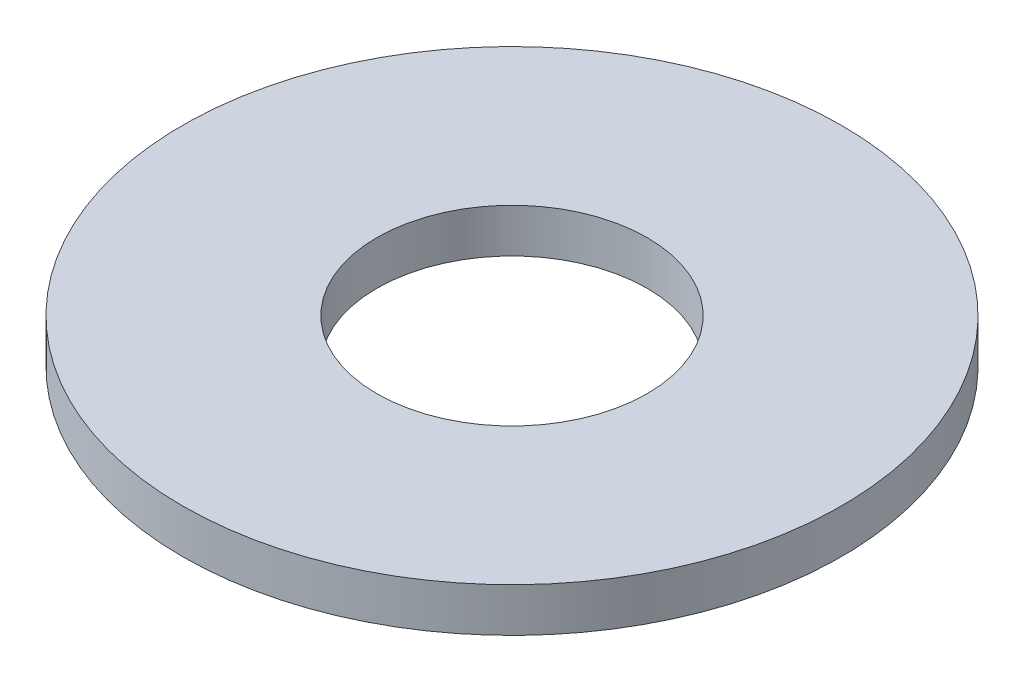
ISO-10303-21;
HEADER;
FILE_DESCRIPTION(('STEP AP214'),'2;1');
FILE_NAME('part.step','',(''),(''),'','','');
FILE_SCHEMA(('AUTOMOTIVE_DESIGN { 1 0 10303 214 1 1 1 1 }'));
ENDSEC;
DATA;
#1=APPLICATION_CONTEXT('core data for automotive mechanical design processes');
#2=APPLICATION_PROTOCOL_DEFINITION('international standard','automotive_design',2000,#1);
#3=PRODUCT_CONTEXT('',#1,'mechanical');
#4=PRODUCT('Part','Part','',(#3));
#5=PRODUCT_RELATED_PRODUCT_CATEGORY('part','',(#4));
#6=PRODUCT_DEFINITION_FORMATION('','',#4);
#7=PRODUCT_DEFINITION_CONTEXT('part definition',#1,'design');
#8=PRODUCT_DEFINITION('design','',#6,#7);
#9=PRODUCT_DEFINITION_SHAPE('','',#8);
#10=(LENGTH_UNIT() NAMED_UNIT(*) SI_UNIT(.MILLI.,.METRE.));
#11=(NAMED_UNIT(*) PLANE_ANGLE_UNIT() SI_UNIT($,.RADIAN.));
#12=(NAMED_UNIT(*) SI_UNIT($,.STERADIAN.) SOLID_ANGLE_UNIT());
#13=UNCERTAINTY_MEASURE_WITH_UNIT(LENGTH_MEASURE(1.E-05),#10,'distance_accuracy_value','');
#14=(GEOMETRIC_REPRESENTATION_CONTEXT(3) GLOBAL_UNCERTAINTY_ASSIGNED_CONTEXT((#13)) GLOBAL_UNIT_ASSIGNED_CONTEXT((#10,
#11,#12)) REPRESENTATION_CONTEXT('',''));
#15=CARTESIAN_POINT('',(0.,0.,0.));
#16=DIRECTION('',(0.,0.,1.));
#17=DIRECTION('',(1.,0.,0.));
#18=AXIS2_PLACEMENT_3D('',#15,#16,#17);
#19=CARTESIAN_POINT('',(0.,13.,0.));
#20=DIRECTION('',(0.,-1.,0.));
#21=DIRECTION('',(0.,0.,-1.));
#22=AXIS2_PLACEMENT_3D('',#19,#20,#21);
#23=CYLINDRICAL_SURFACE('',#22,97.5);
#24=CARTESIAN_POINT('',(0.,13.,0.));
#25=DIRECTION('',(0.,1.,0.));
#26=DIRECTION('',(0.,0.,1.));
#27=AXIS2_PLACEMENT_3D('',#24,#25,#26);
#28=CIRCLE('',#27,97.5);
#29=CARTESIAN_POINT('',(0.,13.,-97.5));
#30=VERTEX_POINT('',#29);
#31=EDGE_CURVE('E10',#30,#30,#28,.T.);
#32=CARTESIAN_POINT('',(0.,0.,0.));
#33=DIRECTION('',(0.,1.,0.));
#34=DIRECTION('',(0.,0.,1.));
#35=AXIS2_PLACEMENT_3D('',#32,#33,#34);
#36=CIRCLE('',#35,97.5);
#37=CARTESIAN_POINT('',(0.,0.,-97.5));
#38=VERTEX_POINT('',#37);
#39=EDGE_CURVE('E37',#38,#38,#36,.T.);
#40=CARTESIAN_POINT('',(0.,13.,-97.5));
#41=CARTESIAN_POINT('',(0.,12.8645833333333,-97.5));
#42=CARTESIAN_POINT('',(0.,12.7291666666667,-97.5));
#43=CARTESIAN_POINT('',(0.,12.4583333333333,-97.5));
#44=CARTESIAN_POINT('',(0.,12.3229166666667,-97.5));
#45=CARTESIAN_POINT('',(0.,12.0520833333333,-97.5));
#46=CARTESIAN_POINT('',(0.,11.9166666666667,-97.5));
#47=CARTESIAN_POINT('',(0.,11.6458333333333,-97.5));
#48=CARTESIAN_POINT('',(0.,11.5104166666667,-97.5));
#49=CARTESIAN_POINT('',(0.,11.2395833333333,-97.5));
#50=CARTESIAN_POINT('',(0.,11.1041666666667,-97.5));
#51=CARTESIAN_POINT('',(0.,10.8333333333333,-97.5));
#52=CARTESIAN_POINT('',(0.,10.6979166666667,-97.5));
#53=CARTESIAN_POINT('',(0.,10.4270833333333,-97.5));
#54=CARTESIAN_POINT('',(0.,10.2916666666667,-97.5));
#55=CARTESIAN_POINT('',(0.,10.0208333333333,-97.5));
#56=CARTESIAN_POINT('',(0.,9.88541666666667,-97.5));
#57=CARTESIAN_POINT('',(0.,9.61458333333333,-97.5));
#58=CARTESIAN_POINT('',(0.,9.47916666666667,-97.5));
#59=CARTESIAN_POINT('',(0.,9.20833333333333,-97.5));
#60=CARTESIAN_POINT('',(0.,9.07291666666667,-97.5));
#61=CARTESIAN_POINT('',(0.,8.80208333333333,-97.5));
#62=CARTESIAN_POINT('',(0.,8.66666666666667,-97.5));
#63=CARTESIAN_POINT('',(0.,8.39583333333333,-97.5));
#64=CARTESIAN_POINT('',(0.,8.26041666666667,-97.5));
#65=CARTESIAN_POINT('',(0.,7.98958333333333,-97.5));
#66=CARTESIAN_POINT('',(0.,7.85416666666667,-97.5));
#67=CARTESIAN_POINT('',(0.,7.58333333333333,-97.5));
#68=CARTESIAN_POINT('',(0.,7.44791666666667,-97.5));
#69=CARTESIAN_POINT('',(0.,7.17708333333333,-97.5));
#70=CARTESIAN_POINT('',(0.,7.04166666666667,-97.5));
#71=CARTESIAN_POINT('',(0.,6.77083333333333,-97.5));
#72=CARTESIAN_POINT('',(0.,6.63541666666667,-97.5));
#73=CARTESIAN_POINT('',(0.,6.36458333333333,-97.5));
#74=CARTESIAN_POINT('',(0.,6.22916666666667,-97.5));
#75=CARTESIAN_POINT('',(0.,5.95833333333333,-97.5));
#76=CARTESIAN_POINT('',(0.,5.82291666666667,-97.5));
#77=CARTESIAN_POINT('',(0.,5.55208333333333,-97.5));
#78=CARTESIAN_POINT('',(0.,5.41666666666667,-97.5));
#79=CARTESIAN_POINT('',(0.,5.14583333333333,-97.5));
#80=CARTESIAN_POINT('',(0.,5.01041666666667,-97.5));
#81=CARTESIAN_POINT('',(0.,4.73958333333333,-97.5));
#82=CARTESIAN_POINT('',(0.,4.60416666666667,-97.5));
#83=CARTESIAN_POINT('',(0.,4.33333333333333,-97.5));
#84=CARTESIAN_POINT('',(0.,4.19791666666667,-97.5));
#85=CARTESIAN_POINT('',(0.,3.92708333333333,-97.5));
#86=CARTESIAN_POINT('',(0.,3.79166666666667,-97.5));
#87=CARTESIAN_POINT('',(0.,3.52083333333333,-97.5));
#88=CARTESIAN_POINT('',(0.,3.38541666666667,-97.5));
#89=CARTESIAN_POINT('',(0.,3.11458333333333,-97.5));
#90=CARTESIAN_POINT('',(0.,2.97916666666667,-97.5));
#91=CARTESIAN_POINT('',(0.,2.70833333333333,-97.5));
#92=CARTESIAN_POINT('',(0.,2.57291666666667,-97.5));
#93=CARTESIAN_POINT('',(0.,2.30208333333333,-97.5));
#94=CARTESIAN_POINT('',(0.,2.16666666666667,-97.5));
#95=CARTESIAN_POINT('',(0.,1.89583333333333,-97.5));
#96=CARTESIAN_POINT('',(0.,1.76041666666667,-97.5));
#97=CARTESIAN_POINT('',(0.,1.48958333333333,-97.5));
#98=CARTESIAN_POINT('',(0.,1.35416666666667,-97.5));
#99=CARTESIAN_POINT('',(0.,1.08333333333333,-97.5));
#100=CARTESIAN_POINT('',(0.,0.947916666666667,-97.5));
#101=CARTESIAN_POINT('',(0.,0.677083333333334,-97.5));
#102=CARTESIAN_POINT('',(0.,0.541666666666667,-97.5));
#103=CARTESIAN_POINT('',(0.,0.270833333333334,-97.5));
#104=CARTESIAN_POINT('',(0.,0.135416666666667,-97.5));
#105=CARTESIAN_POINT('',(0.,0.,-97.5));
#106=B_SPLINE_CURVE_WITH_KNOTS('',3,(#40,#41,#42,#43,#44,#45,#46,#47,#48,#49,#50,#51,#52,#53,
#54,#55,#56,#57,#58,#59,#60,#61,#62,#63,#64,#65,#66,#67,#68,#69,#70,#71,#72,#73,#74,#75,#76,#77,
#78,#79,#80,#81,#82,#83,#84,#85,#86,#87,#88,#89,#90,#91,#92,#93,#94,#95,#96,#97,#98,#99,#100,
#101,#102,#103,#104,#105),.UNSPECIFIED.,.F.,.F.,(4,2,2,2,2,2,2,2,2,2,2,2,2,2,2,2,2,2,2,2,2,2,2,
2,2,2,2,2,2,2,2,2,4),(0.,0.406249999999999,0.812499999999999,1.21875,1.625,2.03125,2.4375,
2.84375,3.25,3.65625,4.0625,4.46875,4.875,5.28125,5.6875,6.09375,6.5,6.90625,7.3125,7.71875,
8.125,8.53125,8.9375,9.34375,9.75,10.15625,10.5625,10.96875,11.375,11.78125,12.1875,12.59375,
13.),.UNSPECIFIED.);
#107=EDGE_CURVE('BSEAM40',#30,#38,#106,.T.);
#108=ORIENTED_EDGE('',*,*,#31,.F.);
#109=ORIENTED_EDGE('',*,*,#39,.T.);
#110=ORIENTED_EDGE('',*,*,#107,.T.);
#111=ORIENTED_EDGE('',*,*,#107,.F.);
#112=EDGE_LOOP('',(#108,#110,#109,#111));
#113=FACE_BOUND('',#112,.T.);
#114=ADVANCED_FACE('F40',(#113),#23,.T.);
#115=CARTESIAN_POINT('',(0.,13.,0.));
#116=DIRECTION('',(0.,1.,0.));
#117=DIRECTION('',(0.,0.,1.));
#118=AXIS2_PLACEMENT_3D('',#115,#116,#117);
#119=PLANE('',#118);
#120=CARTESIAN_POINT('',(0.,13.,0.));
#121=DIRECTION('',(0.,1.,0.));
#122=DIRECTION('',(0.,0.,1.));
#123=AXIS2_PLACEMENT_3D('',#120,#121,#122);
#124=CIRCLE('',#123,40.);
#125=CARTESIAN_POINT('',(0.,13.,-40.));
#126=VERTEX_POINT('',#125);
#127=EDGE_CURVE('E50',#126,#126,#124,.T.);
#128=ORIENTED_EDGE('',*,*,#127,.F.);
#129=EDGE_LOOP('',(#128));
#130=FACE_BOUND('',#129,.T.);
#131=ORIENTED_EDGE('',*,*,#31,.T.);
#132=EDGE_LOOP('',(#131));
#133=FACE_BOUND('',#132,.T.);
#134=ADVANCED_FACE('F59',(#130,#133),#119,.T.);
#135=CARTESIAN_POINT('',(0.,0.,0.));
#136=DIRECTION('',(0.,1.,0.));
#137=DIRECTION('',(0.,0.,1.));
#138=AXIS2_PLACEMENT_3D('',#135,#136,#137);
#139=PLANE('',#138);
#140=CARTESIAN_POINT('',(0.,0.,0.));
#141=DIRECTION('',(0.,1.,0.));
#142=DIRECTION('',(0.,0.,1.));
#143=AXIS2_PLACEMENT_3D('',#140,#141,#142);
#144=CIRCLE('',#143,40.);
#145=CARTESIAN_POINT('',(0.,0.,-40.));
#146=VERTEX_POINT('',#145);
#147=EDGE_CURVE('E47',#146,#146,#144,.T.);
#148=ORIENTED_EDGE('',*,*,#147,.T.);
#149=EDGE_LOOP('',(#148));
#150=FACE_BOUND('',#149,.T.);
#151=ORIENTED_EDGE('',*,*,#39,.F.);
#152=EDGE_LOOP('',(#151));
#153=FACE_BOUND('',#152,.T.);
#154=ADVANCED_FACE('F58',(#150,#153),#139,.F.);
#155=CARTESIAN_POINT('',(0.,13.,0.));
#156=DIRECTION('',(0.,-1.,0.));
#157=DIRECTION('',(0.,0.,-1.));
#158=AXIS2_PLACEMENT_3D('',#155,#156,#157);
#159=CYLINDRICAL_SURFACE('',#158,40.);
#160=CARTESIAN_POINT('',(0.,13.,-40.));
#161=CARTESIAN_POINT('',(0.,12.8645833333333,-40.));
#162=CARTESIAN_POINT('',(0.,12.7291666666667,-40.));
#163=CARTESIAN_POINT('',(0.,12.4583333333333,-40.));
#164=CARTESIAN_POINT('',(0.,12.3229166666667,-40.));
#165=CARTESIAN_POINT('',(0.,12.0520833333333,-40.));
#166=CARTESIAN_POINT('',(0.,11.9166666666667,-40.));
#167=CARTESIAN_POINT('',(0.,11.6458333333333,-40.));
#168=CARTESIAN_POINT('',(0.,11.5104166666667,-40.));
#169=CARTESIAN_POINT('',(0.,11.2395833333333,-40.));
#170=CARTESIAN_POINT('',(0.,11.1041666666667,-40.));
#171=CARTESIAN_POINT('',(0.,10.8333333333333,-40.));
#172=CARTESIAN_POINT('',(0.,10.6979166666667,-40.));
#173=CARTESIAN_POINT('',(0.,10.4270833333333,-40.));
#174=CARTESIAN_POINT('',(0.,10.2916666666667,-40.));
#175=CARTESIAN_POINT('',(0.,10.0208333333333,-40.));
#176=CARTESIAN_POINT('',(0.,9.88541666666667,-40.));
#177=CARTESIAN_POINT('',(0.,9.61458333333333,-40.));
#178=CARTESIAN_POINT('',(0.,9.47916666666667,-40.));
#179=CARTESIAN_POINT('',(0.,9.20833333333333,-40.));
#180=CARTESIAN_POINT('',(0.,9.07291666666667,-40.));
#181=CARTESIAN_POINT('',(0.,8.80208333333333,-40.));
#182=CARTESIAN_POINT('',(0.,8.66666666666667,-40.));
#183=CARTESIAN_POINT('',(0.,8.39583333333333,-40.));
#184=CARTESIAN_POINT('',(0.,8.26041666666667,-40.));
#185=CARTESIAN_POINT('',(0.,7.98958333333333,-40.));
#186=CARTESIAN_POINT('',(0.,7.85416666666667,-40.));
#187=CARTESIAN_POINT('',(0.,7.58333333333333,-40.));
#188=CARTESIAN_POINT('',(0.,7.44791666666667,-40.));
#189=CARTESIAN_POINT('',(0.,7.17708333333333,-40.));
#190=CARTESIAN_POINT('',(0.,7.04166666666667,-40.));
#191=CARTESIAN_POINT('',(0.,6.77083333333333,-40.));
#192=CARTESIAN_POINT('',(0.,6.63541666666667,-40.));
#193=CARTESIAN_POINT('',(0.,6.36458333333333,-40.));
#194=CARTESIAN_POINT('',(0.,6.22916666666667,-40.));
#195=CARTESIAN_POINT('',(0.,5.95833333333333,-40.));
#196=CARTESIAN_POINT('',(0.,5.82291666666667,-40.));
#197=CARTESIAN_POINT('',(0.,5.55208333333333,-40.));
#198=CARTESIAN_POINT('',(0.,5.41666666666667,-40.));
#199=CARTESIAN_POINT('',(0.,5.14583333333333,-40.));
#200=CARTESIAN_POINT('',(0.,5.01041666666667,-40.));
#201=CARTESIAN_POINT('',(0.,4.73958333333333,-40.));
#202=CARTESIAN_POINT('',(0.,4.60416666666667,-40.));
#203=CARTESIAN_POINT('',(0.,4.33333333333333,-40.));
#204=CARTESIAN_POINT('',(0.,4.19791666666667,-40.));
#205=CARTESIAN_POINT('',(0.,3.92708333333333,-40.));
#206=CARTESIAN_POINT('',(0.,3.79166666666667,-40.));
#207=CARTESIAN_POINT('',(0.,3.52083333333333,-40.));
#208=CARTESIAN_POINT('',(0.,3.38541666666667,-40.));
#209=CARTESIAN_POINT('',(0.,3.11458333333333,-40.));
#210=CARTESIAN_POINT('',(0.,2.97916666666667,-40.));
#211=CARTESIAN_POINT('',(0.,2.70833333333333,-40.));
#212=CARTESIAN_POINT('',(0.,2.57291666666667,-40.));
#213=CARTESIAN_POINT('',(0.,2.30208333333333,-40.));
#214=CARTESIAN_POINT('',(0.,2.16666666666667,-40.));
#215=CARTESIAN_POINT('',(0.,1.89583333333333,-40.));
#216=CARTESIAN_POINT('',(0.,1.76041666666667,-40.));
#217=CARTESIAN_POINT('',(0.,1.48958333333333,-40.));
#218=CARTESIAN_POINT('',(0.,1.35416666666667,-40.));
#219=CARTESIAN_POINT('',(0.,1.08333333333333,-40.));
#220=CARTESIAN_POINT('',(0.,0.947916666666667,-40.));
#221=CARTESIAN_POINT('',(0.,0.677083333333334,-40.));
#222=CARTESIAN_POINT('',(0.,0.541666666666667,-40.));
#223=CARTESIAN_POINT('',(0.,0.270833333333334,-40.));
#224=CARTESIAN_POINT('',(0.,0.135416666666667,-40.));
#225=CARTESIAN_POINT('',(0.,0.,-40.));
#226=B_SPLINE_CURVE_WITH_KNOTS('',3,(#160,#161,#162,#163,#164,#165,#166,#167,#168,#169,#170,
#171,#172,#173,#174,#175,#176,#177,#178,#179,#180,#181,#182,#183,#184,#185,#186,#187,#188,#189,
#190,#191,#192,#193,#194,#195,#196,#197,#198,#199,#200,#201,#202,#203,#204,#205,#206,#207,#208,
#209,#210,#211,#212,#213,#214,#215,#216,#217,#218,#219,#220,#221,#222,#223,#224,#225),
.UNSPECIFIED.,.F.,.F.,(4,2,2,2,2,2,2,2,2,2,2,2,2,2,2,2,2,2,2,2,2,2,2,2,2,2,2,2,2,2,2,2,4),(0.,
0.406249999999999,0.812499999999999,1.21875,1.625,2.03125,2.4375,2.84375,3.25,3.65625,4.0625,
4.46875,4.875,5.28125,5.6875,6.09375,6.5,6.90625,7.3125,7.71875,8.125,8.53125,8.9375,9.34375,
9.75,10.15625,10.5625,10.96875,11.375,11.78125,12.1875,12.59375,13.),.UNSPECIFIED.);
#227=EDGE_CURVE('BSEAM54',#126,#146,#226,.T.);
#228=ORIENTED_EDGE('',*,*,#127,.T.);
#229=ORIENTED_EDGE('',*,*,#147,.F.);
#230=ORIENTED_EDGE('',*,*,#227,.T.);
#231=ORIENTED_EDGE('',*,*,#227,.F.);
#232=EDGE_LOOP('',(#228,#230,#229,#231));
#233=FACE_BOUND('',#232,.T.);
#234=ADVANCED_FACE('F54',(#233),#159,.F.);
#235=CLOSED_SHELL('',(#114,#134,#154,#234));
#236=MANIFOLD_SOLID_BREP('B2',#235);
#237=ADVANCED_BREP_SHAPE_REPRESENTATION('',(#18,#236),#14);
#238=SHAPE_DEFINITION_REPRESENTATION(#9,#237);
ENDSEC;
END-ISO-10303-21;
